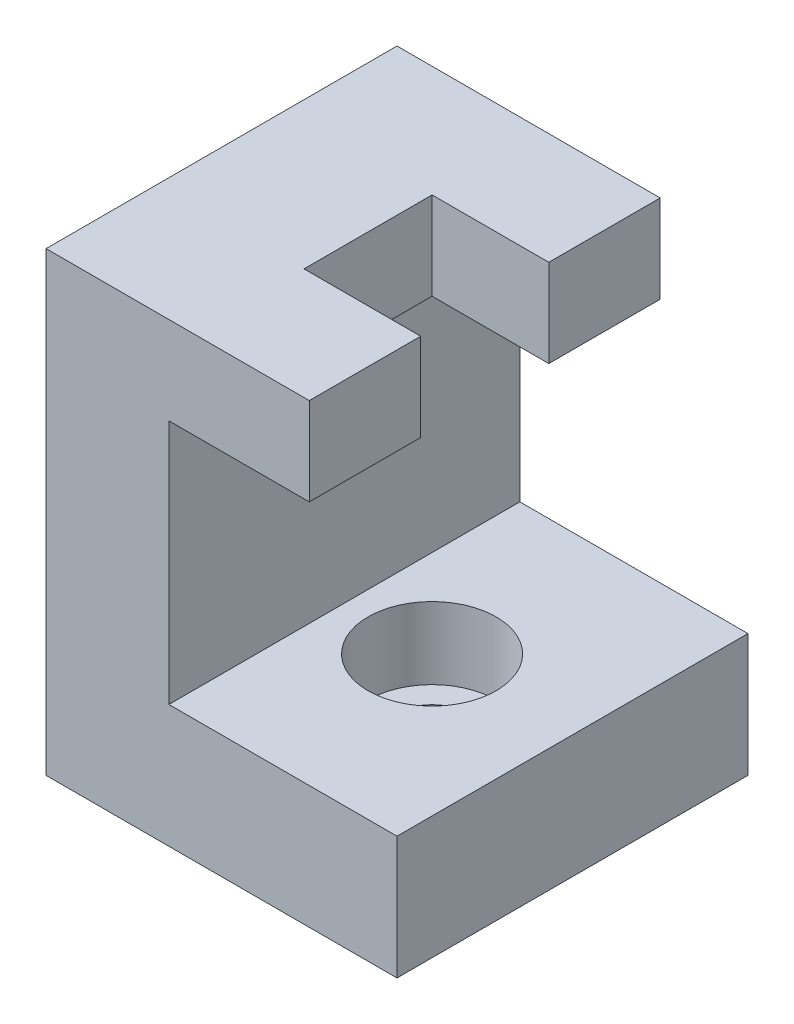
ISO-10303-21;
HEADER;
FILE_DESCRIPTION(('STEP AP214'),'2;1');
FILE_NAME('part.step','',(''),(''),'','','');
FILE_SCHEMA(('AUTOMOTIVE_DESIGN { 1 0 10303 214 1 1 1 1 }'));
ENDSEC;
DATA;
#1=APPLICATION_CONTEXT('core data for automotive mechanical design processes');
#2=APPLICATION_PROTOCOL_DEFINITION('international standard','automotive_design',2000,#1);
#3=PRODUCT_CONTEXT('',#1,'mechanical');
#4=PRODUCT('Part','Part','',(#3));
#5=PRODUCT_RELATED_PRODUCT_CATEGORY('part','',(#4));
#6=PRODUCT_DEFINITION_FORMATION('','',#4);
#7=PRODUCT_DEFINITION_CONTEXT('part definition',#1,'design');
#8=PRODUCT_DEFINITION('design','',#6,#7);
#9=PRODUCT_DEFINITION_SHAPE('','',#8);
#10=(LENGTH_UNIT() NAMED_UNIT(*) SI_UNIT(.MILLI.,.METRE.));
#11=(NAMED_UNIT(*) PLANE_ANGLE_UNIT() SI_UNIT($,.RADIAN.));
#12=(NAMED_UNIT(*) SI_UNIT($,.STERADIAN.) SOLID_ANGLE_UNIT());
#13=UNCERTAINTY_MEASURE_WITH_UNIT(LENGTH_MEASURE(1.E-05),#10,'distance_accuracy_value','');
#14=(GEOMETRIC_REPRESENTATION_CONTEXT(3) GLOBAL_UNCERTAINTY_ASSIGNED_CONTEXT((#13)) GLOBAL_UNIT_ASSIGNED_CONTEXT((#10,
#11,#12)) REPRESENTATION_CONTEXT('',''));
#15=CARTESIAN_POINT('',(0.,0.,0.));
#16=DIRECTION('',(0.,0.,1.));
#17=DIRECTION('',(1.,0.,0.));
#18=AXIS2_PLACEMENT_3D('',#15,#16,#17);
#19=CARTESIAN_POINT('',(15.,0.,10.));
#20=DIRECTION('',(-1.,0.,0.));
#21=DIRECTION('',(0.,0.,1.));
#22=AXIS2_PLACEMENT_3D('',#19,#20,#21);
#23=PLANE('',#22);
#24=DIRECTION('',(0.,0.,-1.));
#25=VECTOR('',#24,1.);
#26=CARTESIAN_POINT('',(15.,21.,10.));
#27=LINE('',#26,#25);
#28=CARTESIAN_POINT('',(15.,21.,10.));
#29=VERTEX_POINT('',#28);
#30=CARTESIAN_POINT('',(15.,21.,3.65));
#31=VERTEX_POINT('',#30);
#32=EDGE_CURVE('E43',#29,#31,#27,.T.);
#33=ORIENTED_EDGE('',*,*,#32,.T.);
#34=DIRECTION('',(0.,-1.,0.));
#35=VECTOR('',#34,1.);
#36=CARTESIAN_POINT('',(15.,-0.001000000000001,3.65));
#37=LINE('',#36,#35);
#38=CARTESIAN_POINT('',(15.,26.,3.65));
#39=VERTEX_POINT('',#38);
#40=EDGE_CURVE('E292',#39,#31,#37,.T.);
#41=ORIENTED_EDGE('',*,*,#40,.F.);
#42=DIRECTION('',(0.,0.,-1.));
#43=VECTOR('',#42,1.);
#44=CARTESIAN_POINT('',(15.,26.,10.));
#45=LINE('',#44,#43);
#46=CARTESIAN_POINT('',(15.,26.,10.));
#47=VERTEX_POINT('',#46);
#48=EDGE_CURVE('E173',#47,#39,#45,.T.);
#49=ORIENTED_EDGE('',*,*,#48,.F.);
#50=DIRECTION('',(0.,1.,0.));
#51=VECTOR('',#50,1.);
#52=CARTESIAN_POINT('',(15.,0.,10.));
#53=LINE('',#52,#51);
#54=EDGE_CURVE('E222',#29,#47,#53,.T.);
#55=ORIENTED_EDGE('',*,*,#54,.F.);
#56=EDGE_LOOP('',(#33,#41,#49,#55));
#57=FACE_BOUND('',#56,.T.);
#58=ADVANCED_FACE('F35',(#57),#23,.F.);
#59=CARTESIAN_POINT('',(7.,0.,10.));
#60=DIRECTION('',(-1.,0.,0.));
#61=DIRECTION('',(0.,0.,1.));
#62=AXIS2_PLACEMENT_3D('',#59,#60,#61);
#63=PLANE('',#62);
#64=DIRECTION('',(0.,1.,0.));
#65=VECTOR('',#64,1.);
#66=CARTESIAN_POINT('',(7.,0.,-10.));
#67=LINE('',#66,#65);
#68=CARTESIAN_POINT('',(7.,7.,-10.));
#69=VERTEX_POINT('',#68);
#70=CARTESIAN_POINT('',(7.,21.,-10.));
#71=VERTEX_POINT('',#70);
#72=EDGE_CURVE('E145',#69,#71,#67,.T.);
#73=ORIENTED_EDGE('',*,*,#72,.T.);
#74=DIRECTION('',(0.,0.,-1.));
#75=VECTOR('',#74,1.);
#76=CARTESIAN_POINT('',(7.,21.,10.));
#77=LINE('',#76,#75);
#78=CARTESIAN_POINT('',(7.,21.,10.));
#79=VERTEX_POINT('',#78);
#80=EDGE_CURVE('E11',#79,#71,#77,.T.);
#81=ORIENTED_EDGE('',*,*,#80,.F.);
#82=DIRECTION('',(0.,1.,0.));
#83=VECTOR('',#82,1.);
#84=CARTESIAN_POINT('',(7.,0.,10.));
#85=LINE('',#84,#83);
#86=CARTESIAN_POINT('',(7.,7.,10.));
#87=VERTEX_POINT('',#86);
#88=EDGE_CURVE('E166',#87,#79,#85,.T.);
#89=ORIENTED_EDGE('',*,*,#88,.F.);
#90=DIRECTION('',(0.,0.,-1.));
#91=VECTOR('',#90,1.);
#92=CARTESIAN_POINT('',(7.,7.,10.));
#93=LINE('',#92,#91);
#94=EDGE_CURVE('E59',#87,#69,#93,.T.);
#95=ORIENTED_EDGE('',*,*,#94,.T.);
#96=EDGE_LOOP('',(#73,#81,#89,#95));
#97=FACE_BOUND('',#96,.T.);
#98=ADVANCED_FACE('F37',(#97),#63,.F.);
#99=CARTESIAN_POINT('',(0.,21.,10.));
#100=DIRECTION('',(0.,1.,0.));
#101=DIRECTION('',(0.,0.,1.));
#102=AXIS2_PLACEMENT_3D('',#99,#100,#101);
#103=PLANE('',#102);
#104=DIRECTION('',(0.,0.,-1.));
#105=VECTOR('',#104,1.);
#106=CARTESIAN_POINT('',(8.35,21.,-3.65));
#107=LINE('',#106,#105);
#108=CARTESIAN_POINT('',(8.35,21.,3.65));
#109=VERTEX_POINT('',#108);
#110=CARTESIAN_POINT('',(8.35,21.,-3.65));
#111=VERTEX_POINT('',#110);
#112=EDGE_CURVE('E296',#109,#111,#107,.T.);
#113=ORIENTED_EDGE('',*,*,#112,.F.);
#114=DIRECTION('',(-1.,0.,0.));
#115=VECTOR('',#114,1.);
#116=CARTESIAN_POINT('',(8.35,21.,3.65));
#117=LINE('',#116,#115);
#118=EDGE_CURVE('E289',#31,#109,#117,.T.);
#119=ORIENTED_EDGE('',*,*,#118,.F.);
#120=ORIENTED_EDGE('',*,*,#32,.F.);
#121=DIRECTION('',(1.,0.,0.));
#122=VECTOR('',#121,1.);
#123=CARTESIAN_POINT('',(0.,21.,10.));
#124=LINE('',#123,#122);
#125=EDGE_CURVE('E98',#79,#29,#124,.T.);
#126=ORIENTED_EDGE('',*,*,#125,.F.);
#127=ORIENTED_EDGE('',*,*,#80,.T.);
#128=DIRECTION('',(1.,0.,0.));
#129=VECTOR('',#128,1.);
#130=CARTESIAN_POINT('',(0.,21.,-10.));
#131=LINE('',#130,#129);
#132=CARTESIAN_POINT('',(15.,21.,-10.));
#133=VERTEX_POINT('',#132);
#134=EDGE_CURVE('E147',#71,#133,#131,.T.);
#135=ORIENTED_EDGE('',*,*,#134,.T.);
#136=CARTESIAN_POINT('',(15.,21.,-3.65));
#137=VERTEX_POINT('',#136);
#138=EDGE_CURVE('E175',#137,#133,#27,.T.);
#139=ORIENTED_EDGE('',*,*,#138,.F.);
#140=DIRECTION('',(1.,0.,0.));
#141=VECTOR('',#140,1.);
#142=CARTESIAN_POINT('',(8.35,21.,-3.65));
#143=LINE('',#142,#141);
#144=EDGE_CURVE('E299',#111,#137,#143,.T.);
#145=ORIENTED_EDGE('',*,*,#144,.F.);
#146=EDGE_LOOP('',(#113,#119,#120,#126,#127,#135,#139,#145));
#147=FACE_BOUND('',#146,.T.);
#148=ADVANCED_FACE('F189',(#147),#103,.F.);
#149=CARTESIAN_POINT('',(15.,26.,-3.65));
#150=VERTEX_POINT('',#149);
#151=CARTESIAN_POINT('',(15.,26.,-10.));
#152=VERTEX_POINT('',#151);
#153=EDGE_CURVE('E172',#150,#152,#45,.T.);
#154=ORIENTED_EDGE('',*,*,#153,.F.);
#155=DIRECTION('',(0.,1.,0.));
#156=VECTOR('',#155,1.);
#157=CARTESIAN_POINT('',(15.,-0.001000000000001,-3.65));
#158=LINE('',#157,#156);
#159=EDGE_CURVE('E50',#137,#150,#158,.T.);
#160=ORIENTED_EDGE('',*,*,#159,.F.);
#161=ORIENTED_EDGE('',*,*,#138,.T.);
#162=DIRECTION('',(0.,1.,0.));
#163=VECTOR('',#162,1.);
#164=CARTESIAN_POINT('',(15.,0.,-10.));
#165=LINE('',#164,#163);
#166=EDGE_CURVE('E151',#133,#152,#165,.T.);
#167=ORIENTED_EDGE('',*,*,#166,.T.);
#168=EDGE_LOOP('',(#154,#160,#161,#167));
#169=FACE_BOUND('',#168,.T.);
#170=ADVANCED_FACE('F184',(#169),#23,.F.);
#171=CARTESIAN_POINT('',(0.,26.,10.));
#172=DIRECTION('',(0.,1.,0.));
#173=DIRECTION('',(0.,0.,1.));
#174=AXIS2_PLACEMENT_3D('',#171,#172,#173);
#175=PLANE('',#174);
#176=DIRECTION('',(1.,0.,0.));
#177=VECTOR('',#176,1.);
#178=CARTESIAN_POINT('',(8.35,26.,3.65));
#179=LINE('',#178,#177);
#180=CARTESIAN_POINT('',(8.35,26.,3.65));
#181=VERTEX_POINT('',#180);
#182=EDGE_CURVE('E208',#181,#39,#179,.T.);
#183=ORIENTED_EDGE('',*,*,#182,.F.);
#184=DIRECTION('',(0.,0.,1.));
#185=VECTOR('',#184,1.);
#186=CARTESIAN_POINT('',(8.35,26.,-3.65));
#187=LINE('',#186,#185);
#188=CARTESIAN_POINT('',(8.35,26.,-3.65));
#189=VERTEX_POINT('',#188);
#190=EDGE_CURVE('E202',#189,#181,#187,.T.);
#191=ORIENTED_EDGE('',*,*,#190,.F.);
#192=DIRECTION('',(-1.,0.,0.));
#193=VECTOR('',#192,1.);
#194=CARTESIAN_POINT('',(8.35,26.,-3.65));
#195=LINE('',#194,#193);
#196=EDGE_CURVE('E200',#150,#189,#195,.T.);
#197=ORIENTED_EDGE('',*,*,#196,.F.);
#198=ORIENTED_EDGE('',*,*,#153,.T.);
#199=DIRECTION('',(1.,0.,0.));
#200=VECTOR('',#199,1.);
#201=CARTESIAN_POINT('',(0.,26.,-10.));
#202=LINE('',#201,#200);
#203=CARTESIAN_POINT('',(0.,26.,-10.));
#204=VERTEX_POINT('',#203);
#205=EDGE_CURVE('E154',#204,#152,#202,.T.);
#206=ORIENTED_EDGE('',*,*,#205,.F.);
#207=DIRECTION('',(0.,0.,-1.));
#208=VECTOR('',#207,1.);
#209=CARTESIAN_POINT('',(0.,26.,10.));
#210=LINE('',#209,#208);
#211=CARTESIAN_POINT('',(0.,26.,10.));
#212=VERTEX_POINT('',#211);
#213=EDGE_CURVE('E170',#212,#204,#210,.T.);
#214=ORIENTED_EDGE('',*,*,#213,.F.);
#215=DIRECTION('',(1.,0.,0.));
#216=VECTOR('',#215,1.);
#217=CARTESIAN_POINT('',(0.,26.,10.));
#218=LINE('',#217,#216);
#219=EDGE_CURVE('E224',#212,#47,#218,.T.);
#220=ORIENTED_EDGE('',*,*,#219,.T.);
#221=ORIENTED_EDGE('',*,*,#48,.T.);
#222=EDGE_LOOP('',(#183,#191,#197,#198,#206,#214,#220,#221));
#223=FACE_BOUND('',#222,.T.);
#224=ADVANCED_FACE('F197',(#223),#175,.T.);
#225=CARTESIAN_POINT('',(0.,0.,10.));
#226=DIRECTION('',(-1.,0.,0.));
#227=DIRECTION('',(0.,0.,1.));
#228=AXIS2_PLACEMENT_3D('',#225,#226,#227);
#229=PLANE('',#228);
#230=DIRECTION('',(0.,1.,0.));
#231=VECTOR('',#230,1.);
#232=CARTESIAN_POINT('',(0.,0.,-10.));
#233=LINE('',#232,#231);
#234=CARTESIAN_POINT('',(0.,0.,-10.));
#235=VERTEX_POINT('',#234);
#236=EDGE_CURVE('E157',#235,#204,#233,.T.);
#237=ORIENTED_EDGE('',*,*,#236,.F.);
#238=DIRECTION('',(0.,0.,-1.));
#239=VECTOR('',#238,1.);
#240=CARTESIAN_POINT('',(0.,0.,10.));
#241=LINE('',#240,#239);
#242=CARTESIAN_POINT('',(0.,0.,10.));
#243=VERTEX_POINT('',#242);
#244=EDGE_CURVE('E136',#243,#235,#241,.T.);
#245=ORIENTED_EDGE('',*,*,#244,.F.);
#246=DIRECTION('',(0.,1.,0.));
#247=VECTOR('',#246,1.);
#248=CARTESIAN_POINT('',(0.,0.,10.));
#249=LINE('',#248,#247);
#250=EDGE_CURVE('E125',#243,#212,#249,.T.);
#251=ORIENTED_EDGE('',*,*,#250,.T.);
#252=ORIENTED_EDGE('',*,*,#213,.T.);
#253=EDGE_LOOP('',(#237,#245,#251,#252));
#254=FACE_BOUND('',#253,.T.);
#255=ADVANCED_FACE('F226',(#254),#229,.T.);
#256=CARTESIAN_POINT('',(0.,0.,10.));
#257=DIRECTION('',(0.,1.,0.));
#258=DIRECTION('',(0.,0.,1.));
#259=AXIS2_PLACEMENT_3D('',#256,#257,#258);
#260=PLANE('',#259);
#261=CARTESIAN_POINT('',(12.,0.,0.));
#262=DIRECTION('',(0.,1.,0.));
#263=DIRECTION('',(0.,0.,1.));
#264=AXIS2_PLACEMENT_3D('',#261,#262,#263);
#265=CIRCLE('',#264,2.25);
#266=CARTESIAN_POINT('',(12.,0.,2.25));
#267=VERTEX_POINT('',#266);
#268=EDGE_CURVE('E288',#267,#267,#265,.F.);
#269=ORIENTED_EDGE('',*,*,#268,.F.);
#270=EDGE_LOOP('',(#269));
#271=FACE_BOUND('',#270,.T.);
#272=DIRECTION('',(1.,0.,0.));
#273=VECTOR('',#272,1.);
#274=CARTESIAN_POINT('',(0.,0.,-10.));
#275=LINE('',#274,#273);
#276=CARTESIAN_POINT('',(20.,0.,-10.));
#277=VERTEX_POINT('',#276);
#278=EDGE_CURVE('E132',#235,#277,#275,.T.);
#279=ORIENTED_EDGE('',*,*,#278,.T.);
#280=DIRECTION('',(0.,0.,-1.));
#281=VECTOR('',#280,1.);
#282=CARTESIAN_POINT('',(20.,0.,10.));
#283=LINE('',#282,#281);
#284=CARTESIAN_POINT('',(20.,0.,10.));
#285=VERTEX_POINT('',#284);
#286=EDGE_CURVE('E129',#285,#277,#283,.T.);
#287=ORIENTED_EDGE('',*,*,#286,.F.);
#288=DIRECTION('',(1.,0.,0.));
#289=VECTOR('',#288,1.);
#290=CARTESIAN_POINT('',(0.,0.,10.));
#291=LINE('',#290,#289);
#292=EDGE_CURVE('E116',#243,#285,#291,.T.);
#293=ORIENTED_EDGE('',*,*,#292,.F.);
#294=ORIENTED_EDGE('',*,*,#244,.T.);
#295=EDGE_LOOP('',(#279,#287,#293,#294));
#296=FACE_BOUND('',#295,.T.);
#297=ADVANCED_FACE('F130',(#271,#296),#260,.F.);
#298=CARTESIAN_POINT('',(20.,0.,10.));
#299=DIRECTION('',(-1.,0.,0.));
#300=DIRECTION('',(0.,0.,1.));
#301=AXIS2_PLACEMENT_3D('',#298,#299,#300);
#302=PLANE('',#301);
#303=DIRECTION('',(0.,1.,0.));
#304=VECTOR('',#303,1.);
#305=CARTESIAN_POINT('',(20.,0.,-10.));
#306=LINE('',#305,#304);
#307=CARTESIAN_POINT('',(20.,7.,-10.));
#308=VERTEX_POINT('',#307);
#309=EDGE_CURVE('E161',#277,#308,#306,.T.);
#310=ORIENTED_EDGE('',*,*,#309,.T.);
#311=DIRECTION('',(0.,0.,-1.));
#312=VECTOR('',#311,1.);
#313=CARTESIAN_POINT('',(20.,7.,10.));
#314=LINE('',#313,#312);
#315=CARTESIAN_POINT('',(20.,7.,10.));
#316=VERTEX_POINT('',#315);
#317=EDGE_CURVE('E137',#316,#308,#314,.T.);
#318=ORIENTED_EDGE('',*,*,#317,.F.);
#319=DIRECTION('',(0.,1.,0.));
#320=VECTOR('',#319,1.);
#321=CARTESIAN_POINT('',(20.,0.,10.));
#322=LINE('',#321,#320);
#323=EDGE_CURVE('E121',#285,#316,#322,.T.);
#324=ORIENTED_EDGE('',*,*,#323,.F.);
#325=ORIENTED_EDGE('',*,*,#286,.T.);
#326=EDGE_LOOP('',(#310,#318,#324,#325));
#327=FACE_BOUND('',#326,.T.);
#328=ADVANCED_FACE('F139',(#327),#302,.F.);
#329=CARTESIAN_POINT('',(0.,7.,10.));
#330=DIRECTION('',(0.,1.,0.));
#331=DIRECTION('',(0.,0.,1.));
#332=AXIS2_PLACEMENT_3D('',#329,#330,#331);
#333=PLANE('',#332);
#334=CARTESIAN_POINT('',(12.,7.,0.));
#335=DIRECTION('',(0.,1.,0.));
#336=DIRECTION('',(0.,0.,1.));
#337=AXIS2_PLACEMENT_3D('',#334,#335,#336);
#338=CIRCLE('',#337,3.65);
#339=CARTESIAN_POINT('',(12.,7.,3.65));
#340=VERTEX_POINT('',#339);
#341=EDGE_CURVE('E204',#340,#340,#338,.T.);
#342=ORIENTED_EDGE('',*,*,#341,.F.);
#343=EDGE_LOOP('',(#342));
#344=FACE_BOUND('',#343,.T.);
#345=DIRECTION('',(1.,0.,0.));
#346=VECTOR('',#345,1.);
#347=CARTESIAN_POINT('',(0.,7.,-10.));
#348=LINE('',#347,#346);
#349=EDGE_CURVE('E163',#69,#308,#348,.T.);
#350=ORIENTED_EDGE('',*,*,#349,.F.);
#351=ORIENTED_EDGE('',*,*,#94,.F.);
#352=DIRECTION('',(1.,0.,0.));
#353=VECTOR('',#352,1.);
#354=CARTESIAN_POINT('',(0.,7.,10.));
#355=LINE('',#354,#353);
#356=EDGE_CURVE('E140',#87,#316,#355,.T.);
#357=ORIENTED_EDGE('',*,*,#356,.T.);
#358=ORIENTED_EDGE('',*,*,#317,.T.);
#359=EDGE_LOOP('',(#350,#351,#357,#358));
#360=FACE_BOUND('',#359,.T.);
#361=ADVANCED_FACE('F227',(#344,#360),#333,.T.);
#362=CARTESIAN_POINT('',(0.,0.,10.));
#363=DIRECTION('',(0.,0.,1.));
#364=DIRECTION('',(1.,0.,0.));
#365=AXIS2_PLACEMENT_3D('',#362,#363,#364);
#366=PLANE('',#365);
#367=ORIENTED_EDGE('',*,*,#88,.T.);
#368=ORIENTED_EDGE('',*,*,#125,.T.);
#369=ORIENTED_EDGE('',*,*,#54,.T.);
#370=ORIENTED_EDGE('',*,*,#219,.F.);
#371=ORIENTED_EDGE('',*,*,#250,.F.);
#372=ORIENTED_EDGE('',*,*,#292,.T.);
#373=ORIENTED_EDGE('',*,*,#323,.T.);
#374=ORIENTED_EDGE('',*,*,#356,.F.);
#375=EDGE_LOOP('',(#367,#368,#369,#370,#371,#372,#373,#374));
#376=FACE_BOUND('',#375,.T.);
#377=ADVANCED_FACE('F118',(#376),#366,.T.);
#378=CARTESIAN_POINT('',(0.,0.,-10.));
#379=DIRECTION('',(0.,0.,1.));
#380=DIRECTION('',(1.,0.,0.));
#381=AXIS2_PLACEMENT_3D('',#378,#379,#380);
#382=PLANE('',#381);
#383=ORIENTED_EDGE('',*,*,#72,.F.);
#384=ORIENTED_EDGE('',*,*,#349,.T.);
#385=ORIENTED_EDGE('',*,*,#309,.F.);
#386=ORIENTED_EDGE('',*,*,#278,.F.);
#387=ORIENTED_EDGE('',*,*,#236,.T.);
#388=ORIENTED_EDGE('',*,*,#205,.T.);
#389=ORIENTED_EDGE('',*,*,#166,.F.);
#390=ORIENTED_EDGE('',*,*,#134,.F.);
#391=EDGE_LOOP('',(#383,#384,#385,#386,#387,#388,#389,#390));
#392=FACE_BOUND('',#391,.T.);
#393=ADVANCED_FACE('F192',(#392),#382,.F.);
#394=CARTESIAN_POINT('',(12.,2.9,0.));
#395=DIRECTION('',(0.,1.,0.));
#396=DIRECTION('',(0.,0.,1.));
#397=AXIS2_PLACEMENT_3D('',#394,#395,#396);
#398=CYLINDRICAL_SURFACE('',#397,3.65);
#399=CARTESIAN_POINT('',(12.,2.9,0.));
#400=DIRECTION('',(0.,1.,0.));
#401=DIRECTION('',(0.,0.,1.));
#402=AXIS2_PLACEMENT_3D('',#399,#400,#401);
#403=CIRCLE('',#402,3.65);
#404=CARTESIAN_POINT('',(12.,2.9,3.65));
#405=VERTEX_POINT('',#404);
#406=EDGE_CURVE('E148',#405,#405,#403,.T.);
#407=ORIENTED_EDGE('',*,*,#406,.F.);
#408=EDGE_LOOP('',(#407));
#409=FACE_BOUND('',#408,.T.);
#410=ORIENTED_EDGE('',*,*,#341,.T.);
#411=EDGE_LOOP('',(#410));
#412=FACE_BOUND('',#411,.T.);
#413=ADVANCED_FACE('F256',(#409,#412),#398,.F.);
#414=CARTESIAN_POINT('',(12.,2.9,0.));
#415=DIRECTION('',(0.,1.,0.));
#416=DIRECTION('',(0.,0.,1.));
#417=AXIS2_PLACEMENT_3D('',#414,#415,#416);
#418=PLANE('',#417);
#419=CARTESIAN_POINT('',(12.,2.9,0.));
#420=DIRECTION('',(0.,1.,0.));
#421=DIRECTION('',(0.,0.,1.));
#422=AXIS2_PLACEMENT_3D('',#419,#420,#421);
#423=CIRCLE('',#422,2.25);
#424=CARTESIAN_POINT('',(12.,2.9,2.25));
#425=VERTEX_POINT('',#424);
#426=EDGE_CURVE('E285',#425,#425,#423,.T.);
#427=ORIENTED_EDGE('',*,*,#426,.F.);
#428=EDGE_LOOP('',(#427));
#429=FACE_BOUND('',#428,.T.);
#430=ORIENTED_EDGE('',*,*,#406,.T.);
#431=EDGE_LOOP('',(#430));
#432=FACE_BOUND('',#431,.T.);
#433=ADVANCED_FACE('F261',(#429,#432),#418,.T.);
#434=CARTESIAN_POINT('',(8.35,-0.001000000000001,3.65));
#435=DIRECTION('',(0.,0.,1.));
#436=DIRECTION('',(1.,0.,0.));
#437=AXIS2_PLACEMENT_3D('',#434,#435,#436);
#438=PLANE('',#437);
#439=ORIENTED_EDGE('',*,*,#118,.T.);
#440=DIRECTION('',(0.,1.,0.));
#441=VECTOR('',#440,1.);
#442=CARTESIAN_POINT('',(8.35,-0.001000000000001,3.65));
#443=LINE('',#442,#441);
#444=EDGE_CURVE('E212',#109,#181,#443,.T.);
#445=ORIENTED_EDGE('',*,*,#444,.T.);
#446=ORIENTED_EDGE('',*,*,#182,.T.);
#447=ORIENTED_EDGE('',*,*,#40,.T.);
#448=EDGE_LOOP('',(#439,#445,#446,#447));
#449=FACE_BOUND('',#448,.T.);
#450=ADVANCED_FACE('F265',(#449),#438,.F.);
#451=CARTESIAN_POINT('',(8.35,-0.001000000000001,-3.65));
#452=DIRECTION('',(-1.,0.,0.));
#453=DIRECTION('',(0.,0.,1.));
#454=AXIS2_PLACEMENT_3D('',#451,#452,#453);
#455=PLANE('',#454);
#456=ORIENTED_EDGE('',*,*,#112,.T.);
#457=DIRECTION('',(0.,1.,0.));
#458=VECTOR('',#457,1.);
#459=CARTESIAN_POINT('',(8.35,-0.001000000000001,-3.65));
#460=LINE('',#459,#458);
#461=EDGE_CURVE('E215',#111,#189,#460,.T.);
#462=ORIENTED_EDGE('',*,*,#461,.T.);
#463=ORIENTED_EDGE('',*,*,#190,.T.);
#464=ORIENTED_EDGE('',*,*,#444,.F.);
#465=EDGE_LOOP('',(#456,#462,#463,#464));
#466=FACE_BOUND('',#465,.T.);
#467=ADVANCED_FACE('F271',(#466),#455,.F.);
#468=CARTESIAN_POINT('',(8.35,-0.001000000000001,-3.65));
#469=DIRECTION('',(0.,0.,-1.));
#470=DIRECTION('',(-1.,0.,0.));
#471=AXIS2_PLACEMENT_3D('',#468,#469,#470);
#472=PLANE('',#471);
#473=ORIENTED_EDGE('',*,*,#144,.T.);
#474=ORIENTED_EDGE('',*,*,#159,.T.);
#475=ORIENTED_EDGE('',*,*,#196,.T.);
#476=ORIENTED_EDGE('',*,*,#461,.F.);
#477=EDGE_LOOP('',(#473,#474,#475,#476));
#478=FACE_BOUND('',#477,.T.);
#479=ADVANCED_FACE('F267',(#478),#472,.F.);
#480=CARTESIAN_POINT('',(12.,-0.00100000000000013,0.));
#481=DIRECTION('',(0.,1.,0.));
#482=DIRECTION('',(0.,0.,1.));
#483=AXIS2_PLACEMENT_3D('',#480,#481,#482);
#484=CYLINDRICAL_SURFACE('',#483,2.25);
#485=ORIENTED_EDGE('',*,*,#426,.T.);
#486=EDGE_LOOP('',(#485));
#487=FACE_BOUND('',#486,.T.);
#488=ORIENTED_EDGE('',*,*,#268,.T.);
#489=EDGE_LOOP('',(#488));
#490=FACE_BOUND('',#489,.T.);
#491=ADVANCED_FACE('F270',(#487,#490),#484,.F.);
#492=CLOSED_SHELL('',(#58,#98,#148,#170,#224,#255,#297,#328,#361,#377,#393,#413,#433,#450,#467,
#479,#491));
#493=MANIFOLD_SOLID_BREP('B2',#492);
#494=ADVANCED_BREP_SHAPE_REPRESENTATION('',(#18,#493),#14);
#495=SHAPE_DEFINITION_REPRESENTATION(#9,#494);
ENDSEC;
END-ISO-10303-21;
